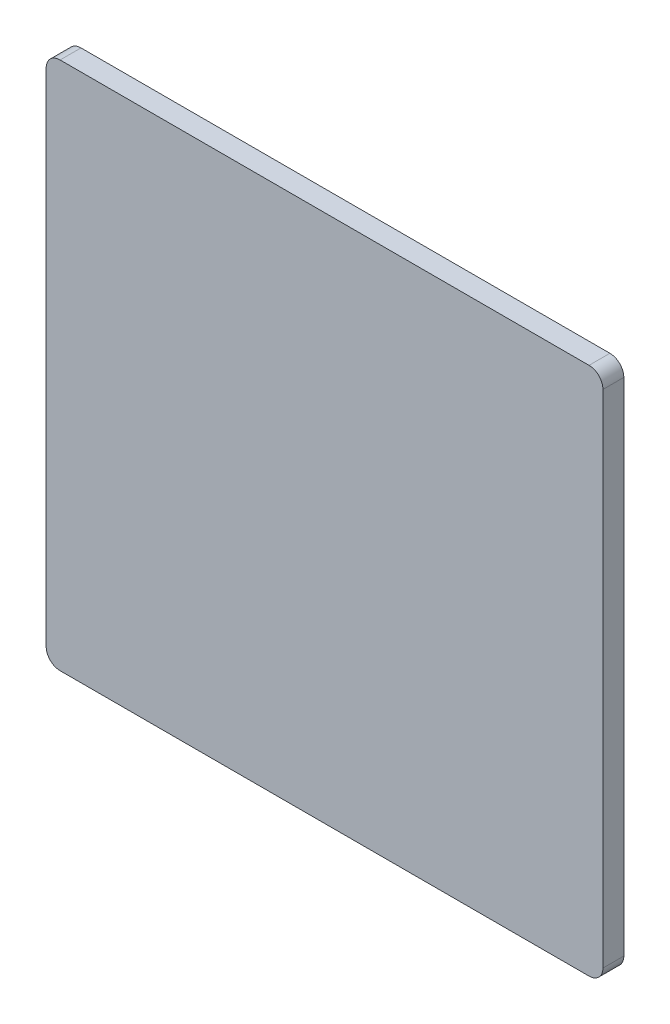
ISO-10303-21;
HEADER;
FILE_DESCRIPTION(('STEP AP214'),'2;1');
FILE_NAME('part.step','',(''),(''),'','','');
FILE_SCHEMA(('AUTOMOTIVE_DESIGN { 1 0 10303 214 1 1 1 1 }'));
ENDSEC;
DATA;
#1=APPLICATION_CONTEXT('core data for automotive mechanical design processes');
#2=APPLICATION_PROTOCOL_DEFINITION('international standard','automotive_design',2000,#1);
#3=PRODUCT_CONTEXT('',#1,'mechanical');
#4=PRODUCT('Part','Part','',(#3));
#5=PRODUCT_RELATED_PRODUCT_CATEGORY('part','',(#4));
#6=PRODUCT_DEFINITION_FORMATION('','',#4);
#7=PRODUCT_DEFINITION_CONTEXT('part definition',#1,'design');
#8=PRODUCT_DEFINITION('design','',#6,#7);
#9=PRODUCT_DEFINITION_SHAPE('','',#8);
#10=(LENGTH_UNIT() NAMED_UNIT(*) SI_UNIT(.MILLI.,.METRE.));
#11=(NAMED_UNIT(*) PLANE_ANGLE_UNIT() SI_UNIT($,.RADIAN.));
#12=(NAMED_UNIT(*) SI_UNIT($,.STERADIAN.) SOLID_ANGLE_UNIT());
#13=UNCERTAINTY_MEASURE_WITH_UNIT(LENGTH_MEASURE(1.E-05),#10,'distance_accuracy_value','');
#14=(GEOMETRIC_REPRESENTATION_CONTEXT(3) GLOBAL_UNCERTAINTY_ASSIGNED_CONTEXT((#13)) GLOBAL_UNIT_ASSIGNED_CONTEXT((#10,
#11,#12)) REPRESENTATION_CONTEXT('',''));
#15=CARTESIAN_POINT('',(0.,0.,0.));
#16=DIRECTION('',(0.,0.,1.));
#17=DIRECTION('',(1.,0.,0.));
#18=AXIS2_PLACEMENT_3D('',#15,#16,#17);
#19=CARTESIAN_POINT('',(127.,-120.65,9.525));
#20=DIRECTION('',(-1.,0.,0.));
#21=DIRECTION('',(0.,0.,1.));
#22=AXIS2_PLACEMENT_3D('',#19,#20,#21);
#23=PLANE('',#22);
#24=DIRECTION('',(0.,1.,0.));
#25=VECTOR('',#24,1.);
#26=CARTESIAN_POINT('',(127.,-120.65,9.525));
#27=LINE('',#26,#25);
#28=CARTESIAN_POINT('',(127.,-114.3,9.525));
#29=VERTEX_POINT('',#28);
#30=CARTESIAN_POINT('',(127.,114.3,9.525));
#31=VERTEX_POINT('',#30);
#32=EDGE_CURVE('E127',#29,#31,#27,.T.);
#33=ORIENTED_EDGE('',*,*,#32,.F.);
#34=DIRECTION('',(0.,0.,-1.));
#35=VECTOR('',#34,1.);
#36=CARTESIAN_POINT('',(127.,-114.3,9.525));
#37=LINE('',#36,#35);
#38=CARTESIAN_POINT('',(127.,-114.3,0.));
#39=VERTEX_POINT('',#38);
#40=EDGE_CURVE('E153',#29,#39,#37,.T.);
#41=ORIENTED_EDGE('',*,*,#40,.T.);
#42=DIRECTION('',(0.,1.,0.));
#43=VECTOR('',#42,1.);
#44=CARTESIAN_POINT('',(127.,-120.65,0.));
#45=LINE('',#44,#43);
#46=CARTESIAN_POINT('',(127.,114.3,0.));
#47=VERTEX_POINT('',#46);
#48=EDGE_CURVE('E159',#39,#47,#45,.T.);
#49=ORIENTED_EDGE('',*,*,#48,.T.);
#50=DIRECTION('',(0.,0.,-1.));
#51=VECTOR('',#50,1.);
#52=CARTESIAN_POINT('',(127.,114.3,9.525));
#53=LINE('',#52,#51);
#54=EDGE_CURVE('E151',#47,#31,#53,.F.);
#55=ORIENTED_EDGE('',*,*,#54,.T.);
#56=EDGE_LOOP('',(#33,#41,#49,#55));
#57=FACE_BOUND('',#56,.T.);
#58=ADVANCED_FACE('F35',(#57),#23,.F.);
#59=CARTESIAN_POINT('',(-127.,120.65,9.525));
#60=DIRECTION('',(0.,-1.,0.));
#61=DIRECTION('',(0.,0.,-1.));
#62=AXIS2_PLACEMENT_3D('',#59,#60,#61);
#63=PLANE('',#62);
#64=DIRECTION('',(-1.,0.,0.));
#65=VECTOR('',#64,1.);
#66=CARTESIAN_POINT('',(-127.,120.65,9.525));
#67=LINE('',#66,#65);
#68=CARTESIAN_POINT('',(120.65,120.65,9.525));
#69=VERTEX_POINT('',#68);
#70=CARTESIAN_POINT('',(-120.65,120.65,9.525));
#71=VERTEX_POINT('',#70);
#72=EDGE_CURVE('E130',#69,#71,#67,.T.);
#73=ORIENTED_EDGE('',*,*,#72,.F.);
#74=DIRECTION('',(0.,0.,-1.));
#75=VECTOR('',#74,1.);
#76=CARTESIAN_POINT('',(120.65,120.65,9.525));
#77=LINE('',#76,#75);
#78=CARTESIAN_POINT('',(120.65,120.65,0.));
#79=VERTEX_POINT('',#78);
#80=EDGE_CURVE('E11',#69,#79,#77,.T.);
#81=ORIENTED_EDGE('',*,*,#80,.T.);
#82=DIRECTION('',(-1.,0.,0.));
#83=VECTOR('',#82,1.);
#84=CARTESIAN_POINT('',(-127.,120.65,0.));
#85=LINE('',#84,#83);
#86=CARTESIAN_POINT('',(-120.65,120.65,0.));
#87=VERTEX_POINT('',#86);
#88=EDGE_CURVE('E132',#79,#87,#85,.T.);
#89=ORIENTED_EDGE('',*,*,#88,.T.);
#90=DIRECTION('',(0.,0.,-1.));
#91=VECTOR('',#90,1.);
#92=CARTESIAN_POINT('',(-120.65,120.65,9.525));
#93=LINE('',#92,#91);
#94=EDGE_CURVE('E43',#87,#71,#93,.F.);
#95=ORIENTED_EDGE('',*,*,#94,.T.);
#96=EDGE_LOOP('',(#73,#81,#89,#95));
#97=FACE_BOUND('',#96,.T.);
#98=ADVANCED_FACE('F178',(#97),#63,.F.);
#99=CARTESIAN_POINT('',(-127.,-120.65,9.525));
#100=DIRECTION('',(1.,0.,0.));
#101=DIRECTION('',(0.,0.,-1.));
#102=AXIS2_PLACEMENT_3D('',#99,#100,#101);
#103=PLANE('',#102);
#104=DIRECTION('',(0.,-1.,0.));
#105=VECTOR('',#104,1.);
#106=CARTESIAN_POINT('',(-127.,-120.65,0.));
#107=LINE('',#106,#105);
#108=CARTESIAN_POINT('',(-127.,114.3,0.));
#109=VERTEX_POINT('',#108);
#110=CARTESIAN_POINT('',(-127.,-114.3,0.));
#111=VERTEX_POINT('',#110);
#112=EDGE_CURVE('E128',#109,#111,#107,.T.);
#113=ORIENTED_EDGE('',*,*,#112,.T.);
#114=DIRECTION('',(0.,0.,-1.));
#115=VECTOR('',#114,1.);
#116=CARTESIAN_POINT('',(-127.,-114.3,9.525));
#117=LINE('',#116,#115);
#118=CARTESIAN_POINT('',(-127.,-114.3,9.525));
#119=VERTEX_POINT('',#118);
#120=EDGE_CURVE('E106',#111,#119,#117,.F.);
#121=ORIENTED_EDGE('',*,*,#120,.T.);
#122=DIRECTION('',(0.,-1.,0.));
#123=VECTOR('',#122,1.);
#124=CARTESIAN_POINT('',(-127.,-120.65,9.525));
#125=LINE('',#124,#123);
#126=CARTESIAN_POINT('',(-127.,114.3,9.525));
#127=VERTEX_POINT('',#126);
#128=EDGE_CURVE('E167',#127,#119,#125,.T.);
#129=ORIENTED_EDGE('',*,*,#128,.F.);
#130=DIRECTION('',(0.,0.,-1.));
#131=VECTOR('',#130,1.);
#132=CARTESIAN_POINT('',(-127.,114.3,9.525));
#133=LINE('',#132,#131);
#134=EDGE_CURVE('E111',#127,#109,#133,.T.);
#135=ORIENTED_EDGE('',*,*,#134,.T.);
#136=EDGE_LOOP('',(#113,#121,#129,#135));
#137=FACE_BOUND('',#136,.T.);
#138=ADVANCED_FACE('F177',(#137),#103,.F.);
#139=CARTESIAN_POINT('',(-127.,-120.65,9.525));
#140=DIRECTION('',(0.,1.,0.));
#141=DIRECTION('',(0.,0.,1.));
#142=AXIS2_PLACEMENT_3D('',#139,#140,#141);
#143=PLANE('',#142);
#144=DIRECTION('',(1.,0.,0.));
#145=VECTOR('',#144,1.);
#146=CARTESIAN_POINT('',(-127.,-120.65,9.525));
#147=LINE('',#146,#145);
#148=CARTESIAN_POINT('',(-120.65,-120.65,9.525));
#149=VERTEX_POINT('',#148);
#150=CARTESIAN_POINT('',(120.65,-120.65,9.525));
#151=VERTEX_POINT('',#150);
#152=EDGE_CURVE('E121',#149,#151,#147,.T.);
#153=ORIENTED_EDGE('',*,*,#152,.F.);
#154=DIRECTION('',(0.,0.,-1.));
#155=VECTOR('',#154,1.);
#156=CARTESIAN_POINT('',(-120.65,-120.65,9.525));
#157=LINE('',#156,#155);
#158=CARTESIAN_POINT('',(-120.65,-120.65,0.));
#159=VERTEX_POINT('',#158);
#160=EDGE_CURVE('E105',#149,#159,#157,.T.);
#161=ORIENTED_EDGE('',*,*,#160,.T.);
#162=DIRECTION('',(1.,0.,0.));
#163=VECTOR('',#162,1.);
#164=CARTESIAN_POINT('',(-127.,-120.65,0.));
#165=LINE('',#164,#163);
#166=CARTESIAN_POINT('',(120.65,-120.65,0.));
#167=VERTEX_POINT('',#166);
#168=EDGE_CURVE('E118',#159,#167,#165,.T.);
#169=ORIENTED_EDGE('',*,*,#168,.T.);
#170=DIRECTION('',(0.,0.,-1.));
#171=VECTOR('',#170,1.);
#172=CARTESIAN_POINT('',(120.65,-120.65,9.525));
#173=LINE('',#172,#171);
#174=EDGE_CURVE('E123',#167,#151,#173,.F.);
#175=ORIENTED_EDGE('',*,*,#174,.T.);
#176=EDGE_LOOP('',(#153,#161,#169,#175));
#177=FACE_BOUND('',#176,.T.);
#178=ADVANCED_FACE('F117',(#177),#143,.F.);
#179=CARTESIAN_POINT('',(0.,0.,9.525));
#180=DIRECTION('',(0.,0.,-1.));
#181=DIRECTION('',(-1.,0.,0.));
#182=AXIS2_PLACEMENT_3D('',#179,#180,#181);
#183=PLANE('',#182);
#184=ORIENTED_EDGE('',*,*,#128,.T.);
#185=CARTESIAN_POINT('',(-120.65,-114.3,9.525));
#186=DIRECTION('',(0.,0.,-1.));
#187=DIRECTION('',(-1.,0.,0.));
#188=AXIS2_PLACEMENT_3D('',#185,#186,#187);
#189=CIRCLE('',#188,6.35);
#190=EDGE_CURVE('E149',#119,#149,#189,.F.);
#191=ORIENTED_EDGE('',*,*,#190,.T.);
#192=ORIENTED_EDGE('',*,*,#152,.T.);
#193=CARTESIAN_POINT('',(120.65,-114.3,9.525));
#194=DIRECTION('',(0.,0.,-1.));
#195=DIRECTION('',(-1.,0.,0.));
#196=AXIS2_PLACEMENT_3D('',#193,#194,#195);
#197=CIRCLE('',#196,6.35);
#198=EDGE_CURVE('E147',#151,#29,#197,.F.);
#199=ORIENTED_EDGE('',*,*,#198,.T.);
#200=ORIENTED_EDGE('',*,*,#32,.T.);
#201=CARTESIAN_POINT('',(120.65,114.3,9.525));
#202=DIRECTION('',(0.,0.,-1.));
#203=DIRECTION('',(-1.,0.,0.));
#204=AXIS2_PLACEMENT_3D('',#201,#202,#203);
#205=CIRCLE('',#204,6.35);
#206=EDGE_CURVE('E56',#31,#69,#205,.F.);
#207=ORIENTED_EDGE('',*,*,#206,.T.);
#208=ORIENTED_EDGE('',*,*,#72,.T.);
#209=CARTESIAN_POINT('',(-120.65,114.3,9.525));
#210=DIRECTION('',(0.,0.,-1.));
#211=DIRECTION('',(-1.,0.,0.));
#212=AXIS2_PLACEMENT_3D('',#209,#210,#211);
#213=CIRCLE('',#212,6.35);
#214=EDGE_CURVE('E144',#71,#127,#213,.F.);
#215=ORIENTED_EDGE('',*,*,#214,.T.);
#216=EDGE_LOOP('',(#184,#191,#192,#199,#200,#207,#208,#215));
#217=FACE_BOUND('',#216,.T.);
#218=ADVANCED_FACE('F171',(#217),#183,.F.);
#219=CARTESIAN_POINT('',(0.,0.,0.));
#220=DIRECTION('',(0.,0.,-1.));
#221=DIRECTION('',(-1.,0.,0.));
#222=AXIS2_PLACEMENT_3D('',#219,#220,#221);
#223=PLANE('',#222);
#224=ORIENTED_EDGE('',*,*,#168,.F.);
#225=CARTESIAN_POINT('',(-120.65,-114.3,0.));
#226=DIRECTION('',(0.,0.,-1.));
#227=DIRECTION('',(-1.,0.,0.));
#228=AXIS2_PLACEMENT_3D('',#225,#226,#227);
#229=CIRCLE('',#228,6.35);
#230=EDGE_CURVE('E101',#159,#111,#229,.T.);
#231=ORIENTED_EDGE('',*,*,#230,.T.);
#232=ORIENTED_EDGE('',*,*,#112,.F.);
#233=CARTESIAN_POINT('',(-120.65,114.3,0.));
#234=DIRECTION('',(0.,0.,-1.));
#235=DIRECTION('',(-1.,0.,0.));
#236=AXIS2_PLACEMENT_3D('',#233,#234,#235);
#237=CIRCLE('',#236,6.35);
#238=EDGE_CURVE('E122',#109,#87,#237,.T.);
#239=ORIENTED_EDGE('',*,*,#238,.T.);
#240=ORIENTED_EDGE('',*,*,#88,.F.);
#241=CARTESIAN_POINT('',(120.65,114.3,0.));
#242=DIRECTION('',(0.,0.,-1.));
#243=DIRECTION('',(-1.,0.,0.));
#244=AXIS2_PLACEMENT_3D('',#241,#242,#243);
#245=CIRCLE('',#244,6.35);
#246=EDGE_CURVE('E138',#79,#47,#245,.T.);
#247=ORIENTED_EDGE('',*,*,#246,.T.);
#248=ORIENTED_EDGE('',*,*,#48,.F.);
#249=CARTESIAN_POINT('',(120.65,-114.3,0.));
#250=DIRECTION('',(0.,0.,-1.));
#251=DIRECTION('',(-1.,0.,0.));
#252=AXIS2_PLACEMENT_3D('',#249,#250,#251);
#253=CIRCLE('',#252,6.35);
#254=EDGE_CURVE('E112',#39,#167,#253,.T.);
#255=ORIENTED_EDGE('',*,*,#254,.T.);
#256=EDGE_LOOP('',(#224,#231,#232,#239,#240,#247,#248,#255));
#257=FACE_BOUND('',#256,.T.);
#258=ADVANCED_FACE('F125',(#257),#223,.T.);
#259=CARTESIAN_POINT('',(-120.65,-114.3,9.525));
#260=DIRECTION('',(0.,0.,-1.));
#261=DIRECTION('',(-1.,0.,0.));
#262=AXIS2_PLACEMENT_3D('',#259,#260,#261);
#263=CYLINDRICAL_SURFACE('',#262,6.35);
#264=ORIENTED_EDGE('',*,*,#190,.F.);
#265=ORIENTED_EDGE('',*,*,#120,.F.);
#266=ORIENTED_EDGE('',*,*,#230,.F.);
#267=ORIENTED_EDGE('',*,*,#160,.F.);
#268=EDGE_LOOP('',(#264,#265,#266,#267));
#269=FACE_BOUND('',#268,.T.);
#270=ADVANCED_FACE('F104',(#269),#263,.T.);
#271=CARTESIAN_POINT('',(120.65,-114.3,9.525));
#272=DIRECTION('',(0.,0.,-1.));
#273=DIRECTION('',(-1.,0.,0.));
#274=AXIS2_PLACEMENT_3D('',#271,#272,#273);
#275=CYLINDRICAL_SURFACE('',#274,6.35);
#276=ORIENTED_EDGE('',*,*,#198,.F.);
#277=ORIENTED_EDGE('',*,*,#174,.F.);
#278=ORIENTED_EDGE('',*,*,#254,.F.);
#279=ORIENTED_EDGE('',*,*,#40,.F.);
#280=EDGE_LOOP('',(#276,#277,#278,#279));
#281=FACE_BOUND('',#280,.T.);
#282=ADVANCED_FACE('F181',(#281),#275,.T.);
#283=CARTESIAN_POINT('',(120.65,114.3,9.525));
#284=DIRECTION('',(0.,0.,-1.));
#285=DIRECTION('',(-1.,0.,0.));
#286=AXIS2_PLACEMENT_3D('',#283,#284,#285);
#287=CYLINDRICAL_SURFACE('',#286,6.35);
#288=ORIENTED_EDGE('',*,*,#206,.F.);
#289=ORIENTED_EDGE('',*,*,#54,.F.);
#290=ORIENTED_EDGE('',*,*,#246,.F.);
#291=ORIENTED_EDGE('',*,*,#80,.F.);
#292=EDGE_LOOP('',(#288,#289,#290,#291));
#293=FACE_BOUND('',#292,.T.);
#294=ADVANCED_FACE('F180',(#293),#287,.T.);
#295=CARTESIAN_POINT('',(-120.65,114.3,9.525));
#296=DIRECTION('',(0.,0.,-1.));
#297=DIRECTION('',(-1.,0.,0.));
#298=AXIS2_PLACEMENT_3D('',#295,#296,#297);
#299=CYLINDRICAL_SURFACE('',#298,6.35);
#300=ORIENTED_EDGE('',*,*,#214,.F.);
#301=ORIENTED_EDGE('',*,*,#94,.F.);
#302=ORIENTED_EDGE('',*,*,#238,.F.);
#303=ORIENTED_EDGE('',*,*,#134,.F.);
#304=EDGE_LOOP('',(#300,#301,#302,#303));
#305=FACE_BOUND('',#304,.T.);
#306=ADVANCED_FACE('F37',(#305),#299,.T.);
#307=CLOSED_SHELL('',(#58,#98,#138,#178,#218,#258,#270,#282,#294,#306));
#308=MANIFOLD_SOLID_BREP('B2',#307);
#309=ADVANCED_BREP_SHAPE_REPRESENTATION('',(#18,#308),#14);
#310=SHAPE_DEFINITION_REPRESENTATION(#9,#309);
ENDSEC;
END-ISO-10303-21;
